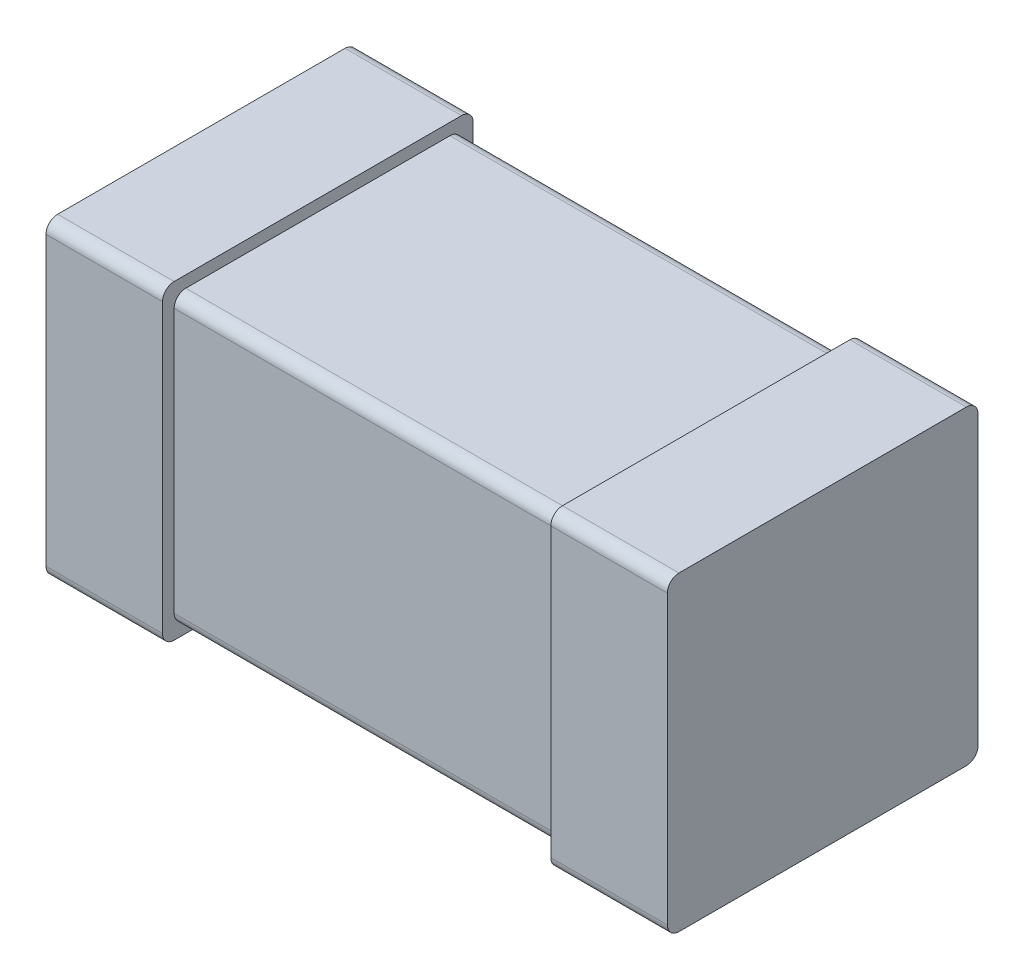
ISO-10303-21;
HEADER;
FILE_DESCRIPTION(('STEP AP214'),'2;1');
FILE_NAME('part.step','',(''),(''),'','','');
FILE_SCHEMA(('AUTOMOTIVE_DESIGN { 1 0 10303 214 1 1 1 1 }'));
ENDSEC;
DATA;
#1=APPLICATION_CONTEXT('core data for automotive mechanical design processes');
#2=APPLICATION_PROTOCOL_DEFINITION('international standard','automotive_design',2000,#1);
#3=PRODUCT_CONTEXT('',#1,'mechanical');
#4=PRODUCT('Part','Part','',(#3));
#5=PRODUCT_RELATED_PRODUCT_CATEGORY('part','',(#4));
#6=PRODUCT_DEFINITION_FORMATION('','',#4);
#7=PRODUCT_DEFINITION_CONTEXT('part definition',#1,'design');
#8=PRODUCT_DEFINITION('design','',#6,#7);
#9=PRODUCT_DEFINITION_SHAPE('','',#8);
#10=(LENGTH_UNIT() NAMED_UNIT(*) SI_UNIT(.MILLI.,.METRE.));
#11=(NAMED_UNIT(*) PLANE_ANGLE_UNIT() SI_UNIT($,.RADIAN.));
#12=(NAMED_UNIT(*) SI_UNIT($,.STERADIAN.) SOLID_ANGLE_UNIT());
#13=UNCERTAINTY_MEASURE_WITH_UNIT(LENGTH_MEASURE(1.E-05),#10,'distance_accuracy_value','');
#14=(GEOMETRIC_REPRESENTATION_CONTEXT(3) GLOBAL_UNCERTAINTY_ASSIGNED_CONTEXT((#13)) GLOBAL_UNIT_ASSIGNED_CONTEXT((#10,
#11,#12)) REPRESENTATION_CONTEXT('',''));
#15=CARTESIAN_POINT('',(0.,0.,0.));
#16=DIRECTION('',(0.,0.,1.));
#17=DIRECTION('',(1.,0.,0.));
#18=AXIS2_PLACEMENT_3D('',#15,#16,#17);
#19=CARTESIAN_POINT('',(182.439544279938,94.8825432923502,112.211582908599));
#20=DIRECTION('',(1.,0.,0.));
#21=DIRECTION('',(0.,1.,0.));
#22=AXIS2_PLACEMENT_3D('',#19,#20,#21);
#23=PLANE('',#22);
#24=DIRECTION('',(0.,0.,1.));
#25=VECTOR('',#24,1.);
#26=CARTESIAN_POINT('',(182.439544279938,94.8825432923502,112.211582908599));
#27=LINE('',#26,#25);
#28=CARTESIAN_POINT('',(182.439544279938,94.8825432923502,112.241582908599));
#29=VERTEX_POINT('',#28);
#30=CARTESIAN_POINT('',(182.439544279938,94.8825432923502,112.981582908599));
#31=VERTEX_POINT('',#30);
#32=EDGE_CURVE('E66',#29,#31,#27,.T.);
#33=ORIENTED_EDGE('',*,*,#32,.F.);
#34=CARTESIAN_POINT('',(182.439544279938,94.9125432923502,112.241582908599));
#35=DIRECTION('',(1.,0.,0.));
#36=DIRECTION('',(0.,0.,1.));
#37=AXIS2_PLACEMENT_3D('',#34,#35,#36);
#38=CIRCLE('',#37,0.0300000000000023);
#39=CARTESIAN_POINT('',(182.439544279938,94.9125432923502,112.211582908599));
#40=VERTEX_POINT('',#39);
#41=EDGE_CURVE('E11',#29,#40,#38,.T.);
#42=ORIENTED_EDGE('',*,*,#41,.T.);
#43=DIRECTION('',(0.,1.,0.));
#44=VECTOR('',#43,1.);
#45=CARTESIAN_POINT('',(182.439544279938,94.8825432923502,112.211582908599));
#46=LINE('',#45,#44);
#47=CARTESIAN_POINT('',(182.439544279938,95.6525432923502,112.211582908599));
#48=VERTEX_POINT('',#47);
#49=EDGE_CURVE('E48',#40,#48,#46,.T.);
#50=ORIENTED_EDGE('',*,*,#49,.T.);
#51=CARTESIAN_POINT('',(182.439544279938,95.6525432923502,112.241582908599));
#52=DIRECTION('',(-1.,0.,0.));
#53=DIRECTION('',(0.,0.,1.));
#54=AXIS2_PLACEMENT_3D('',#51,#52,#53);
#55=CIRCLE('',#54,0.0300000000000023);
#56=CARTESIAN_POINT('',(182.439544279938,95.6825432923502,112.241582908599));
#57=VERTEX_POINT('',#56);
#58=EDGE_CURVE('E304',#57,#48,#55,.T.);
#59=ORIENTED_EDGE('',*,*,#58,.F.);
#60=DIRECTION('',(0.,0.,1.));
#61=VECTOR('',#60,1.);
#62=CARTESIAN_POINT('',(182.439544279938,95.6825432923502,112.211582908599));
#63=LINE('',#62,#61);
#64=CARTESIAN_POINT('',(182.439544279938,95.6825432923502,112.981582908599));
#65=VERTEX_POINT('',#64);
#66=EDGE_CURVE('E350',#57,#65,#63,.T.);
#67=ORIENTED_EDGE('',*,*,#66,.T.);
#68=CARTESIAN_POINT('',(182.439544279938,95.6525432923502,112.981582908599));
#69=DIRECTION('',(1.,0.,0.));
#70=DIRECTION('',(0.,0.,1.));
#71=AXIS2_PLACEMENT_3D('',#68,#69,#70);
#72=CIRCLE('',#71,0.0300000000000023);
#73=CARTESIAN_POINT('',(182.439544279938,95.6525432923502,113.011582908599));
#74=VERTEX_POINT('',#73);
#75=EDGE_CURVE('E354',#65,#74,#72,.T.);
#76=ORIENTED_EDGE('',*,*,#75,.T.);
#77=DIRECTION('',(0.,1.,0.));
#78=VECTOR('',#77,1.);
#79=CARTESIAN_POINT('',(182.439544279938,94.8825432923502,113.011582908599));
#80=LINE('',#79,#78);
#81=CARTESIAN_POINT('',(182.439544279938,94.9125432923502,113.011582908599));
#82=VERTEX_POINT('',#81);
#83=EDGE_CURVE('E372',#82,#74,#80,.T.);
#84=ORIENTED_EDGE('',*,*,#83,.F.);
#85=CARTESIAN_POINT('',(182.439544279938,94.9125432923502,112.981582908599));
#86=DIRECTION('',(-1.,0.,0.));
#87=DIRECTION('',(0.,0.,1.));
#88=AXIS2_PLACEMENT_3D('',#85,#86,#87);
#89=CIRCLE('',#88,0.0300000000000023);
#90=EDGE_CURVE('E292',#31,#82,#89,.T.);
#91=ORIENTED_EDGE('',*,*,#90,.F.);
#92=EDGE_LOOP('',(#33,#42,#50,#59,#67,#76,#84,#91));
#93=FACE_BOUND('',#92,.T.);
#94=ADVANCED_FACE('F44',(#93),#23,.T.);
#95=CARTESIAN_POINT('',(182.139544279938,95.6825432923502,112.211582908599));
#96=DIRECTION('',(0.,1.,0.));
#97=DIRECTION('',(1.,0.,0.));
#98=AXIS2_PLACEMENT_3D('',#95,#96,#97);
#99=PLANE('',#98);
#100=ORIENTED_EDGE('',*,*,#66,.F.);
#101=DIRECTION('',(1.,0.,0.));
#102=VECTOR('',#101,1.);
#103=CARTESIAN_POINT('',(182.139544279938,95.6825432923502,112.241582908599));
#104=LINE('',#103,#102);
#105=CARTESIAN_POINT('',(182.139544279938,95.6825432923502,112.241582908599));
#106=VERTEX_POINT('',#105);
#107=EDGE_CURVE('E307',#106,#57,#104,.T.);
#108=ORIENTED_EDGE('',*,*,#107,.F.);
#109=DIRECTION('',(0.,0.,1.));
#110=VECTOR('',#109,1.);
#111=CARTESIAN_POINT('',(182.139544279938,95.6825432923502,112.211582908599));
#112=LINE('',#111,#110);
#113=CARTESIAN_POINT('',(182.139544279938,95.6825432923502,112.981582908599));
#114=VERTEX_POINT('',#113);
#115=EDGE_CURVE('E369',#106,#114,#112,.T.);
#116=ORIENTED_EDGE('',*,*,#115,.T.);
#117=DIRECTION('',(1.,0.,0.));
#118=VECTOR('',#117,1.);
#119=CARTESIAN_POINT('',(182.139544279938,95.6825432923502,112.981582908599));
#120=LINE('',#119,#118);
#121=EDGE_CURVE('E365',#114,#65,#120,.T.);
#122=ORIENTED_EDGE('',*,*,#121,.T.);
#123=EDGE_LOOP('',(#100,#108,#116,#122));
#124=FACE_BOUND('',#123,.T.);
#125=ADVANCED_FACE('F538',(#124),#99,.T.);
#126=CARTESIAN_POINT('',(182.139544279938,95.6525432923502,112.981582908599));
#127=DIRECTION('',(1.,0.,0.));
#128=DIRECTION('',(0.,1.,0.));
#129=AXIS2_PLACEMENT_3D('',#126,#127,#128);
#130=CYLINDRICAL_SURFACE('',#129,0.0300000000000023);
#131=CARTESIAN_POINT('',(182.139544279938,95.6525432923502,112.981582908599));
#132=DIRECTION('',(1.,0.,0.));
#133=DIRECTION('',(0.,0.,1.));
#134=AXIS2_PLACEMENT_3D('',#131,#132,#133);
#135=CIRCLE('',#134,0.0300000000000023);
#136=CARTESIAN_POINT('',(182.139544279938,95.6525432923502,113.011582908599));
#137=VERTEX_POINT('',#136);
#138=EDGE_CURVE('E349',#114,#137,#135,.T.);
#139=ORIENTED_EDGE('',*,*,#138,.T.);
#140=DIRECTION('',(1.,0.,0.));
#141=VECTOR('',#140,1.);
#142=CARTESIAN_POINT('',(182.139544279938,95.6525432923502,113.011582908599));
#143=LINE('',#142,#141);
#144=EDGE_CURVE('E345',#137,#74,#143,.T.);
#145=ORIENTED_EDGE('',*,*,#144,.T.);
#146=ORIENTED_EDGE('',*,*,#75,.F.);
#147=ORIENTED_EDGE('',*,*,#121,.F.);
#148=EDGE_LOOP('',(#139,#145,#146,#147));
#149=FACE_BOUND('',#148,.T.);
#150=ADVANCED_FACE('F533',(#149),#130,.T.);
#151=CARTESIAN_POINT('',(182.139544279938,95.6525432923502,112.241582908599));
#152=DIRECTION('',(1.,0.,0.));
#153=DIRECTION('',(0.,1.,0.));
#154=AXIS2_PLACEMENT_3D('',#151,#152,#153);
#155=CYLINDRICAL_SURFACE('',#154,0.0300000000000023);
#156=ORIENTED_EDGE('',*,*,#107,.T.);
#157=ORIENTED_EDGE('',*,*,#58,.T.);
#158=DIRECTION('',(1.,0.,0.));
#159=VECTOR('',#158,1.);
#160=CARTESIAN_POINT('',(182.139544279938,95.6525432923502,112.211582908599));
#161=LINE('',#160,#159);
#162=CARTESIAN_POINT('',(182.139544279938,95.6525432923502,112.211582908599));
#163=VERTEX_POINT('',#162);
#164=EDGE_CURVE('E374',#163,#48,#161,.T.);
#165=ORIENTED_EDGE('',*,*,#164,.F.);
#166=CARTESIAN_POINT('',(182.139544279938,95.6525432923502,112.241582908599));
#167=DIRECTION('',(-1.,0.,0.));
#168=DIRECTION('',(0.,0.,1.));
#169=AXIS2_PLACEMENT_3D('',#166,#167,#168);
#170=CIRCLE('',#169,0.0300000000000023);
#171=EDGE_CURVE('E313',#106,#163,#170,.T.);
#172=ORIENTED_EDGE('',*,*,#171,.F.);
#173=EDGE_LOOP('',(#156,#157,#165,#172));
#174=FACE_BOUND('',#173,.T.);
#175=ADVANCED_FACE('F542',(#174),#155,.T.);
#176=CARTESIAN_POINT('',(182.139544279938,94.8825432923502,113.011582908599));
#177=DIRECTION('',(0.,0.,1.));
#178=DIRECTION('',(1.,0.,0.));
#179=AXIS2_PLACEMENT_3D('',#176,#177,#178);
#180=PLANE('',#179);
#181=DIRECTION('',(0.,1.,0.));
#182=VECTOR('',#181,1.);
#183=CARTESIAN_POINT('',(182.139544279938,94.8825432923502,113.011582908599));
#184=LINE('',#183,#182);
#185=CARTESIAN_POINT('',(182.139544279938,94.9125432923502,113.011582908599));
#186=VERTEX_POINT('',#185);
#187=EDGE_CURVE('E446',#186,#137,#184,.T.);
#188=ORIENTED_EDGE('',*,*,#187,.F.);
#189=DIRECTION('',(1.,0.,0.));
#190=VECTOR('',#189,1.);
#191=CARTESIAN_POINT('',(182.139544279938,94.9125432923502,113.011582908599));
#192=LINE('',#191,#190);
#193=EDGE_CURVE('E308',#186,#82,#192,.T.);
#194=ORIENTED_EDGE('',*,*,#193,.T.);
#195=ORIENTED_EDGE('',*,*,#83,.T.);
#196=ORIENTED_EDGE('',*,*,#144,.F.);
#197=EDGE_LOOP('',(#188,#194,#195,#196));
#198=FACE_BOUND('',#197,.T.);
#199=ADVANCED_FACE('F530',(#198),#180,.T.);
#200=CARTESIAN_POINT('',(182.139544279938,94.8825432923502,112.211582908599));
#201=DIRECTION('',(0.,0.,1.));
#202=DIRECTION('',(1.,0.,0.));
#203=AXIS2_PLACEMENT_3D('',#200,#201,#202);
#204=PLANE('',#203);
#205=ORIENTED_EDGE('',*,*,#164,.T.);
#206=ORIENTED_EDGE('',*,*,#49,.F.);
#207=DIRECTION('',(1.,0.,0.));
#208=VECTOR('',#207,1.);
#209=CARTESIAN_POINT('',(182.139544279938,94.9125432923502,112.211582908599));
#210=LINE('',#209,#208);
#211=CARTESIAN_POINT('',(182.139544279938,94.9125432923502,112.211582908599));
#212=VERTEX_POINT('',#211);
#213=EDGE_CURVE('E303',#212,#40,#210,.T.);
#214=ORIENTED_EDGE('',*,*,#213,.F.);
#215=DIRECTION('',(0.,1.,0.));
#216=VECTOR('',#215,1.);
#217=CARTESIAN_POINT('',(182.139544279938,94.8825432923502,112.211582908599));
#218=LINE('',#217,#216);
#219=EDGE_CURVE('E291',#212,#163,#218,.T.);
#220=ORIENTED_EDGE('',*,*,#219,.T.);
#221=EDGE_LOOP('',(#205,#206,#214,#220));
#222=FACE_BOUND('',#221,.T.);
#223=ADVANCED_FACE('F546',(#222),#204,.F.);
#224=CARTESIAN_POINT('',(182.139544279938,94.9125432923502,112.981582908599));
#225=DIRECTION('',(1.,0.,0.));
#226=DIRECTION('',(0.,-1.,0.));
#227=AXIS2_PLACEMENT_3D('',#224,#225,#226);
#228=CYLINDRICAL_SURFACE('',#227,0.0300000000000023);
#229=DIRECTION('',(1.,0.,0.));
#230=VECTOR('',#229,1.);
#231=CARTESIAN_POINT('',(182.139544279938,94.8825432923502,112.981582908599));
#232=LINE('',#231,#230);
#233=CARTESIAN_POINT('',(182.139544279938,94.8825432923502,112.981582908599));
#234=VERTEX_POINT('',#233);
#235=EDGE_CURVE('E287',#234,#31,#232,.T.);
#236=ORIENTED_EDGE('',*,*,#235,.T.);
#237=ORIENTED_EDGE('',*,*,#90,.T.);
#238=ORIENTED_EDGE('',*,*,#193,.F.);
#239=CARTESIAN_POINT('',(182.139544279938,94.9125432923502,112.981582908599));
#240=DIRECTION('',(-1.,0.,0.));
#241=DIRECTION('',(0.,0.,1.));
#242=AXIS2_PLACEMENT_3D('',#239,#240,#241);
#243=CIRCLE('',#242,0.0300000000000023);
#244=EDGE_CURVE('E443',#234,#186,#243,.T.);
#245=ORIENTED_EDGE('',*,*,#244,.F.);
#246=EDGE_LOOP('',(#236,#237,#238,#245));
#247=FACE_BOUND('',#246,.T.);
#248=ADVANCED_FACE('F524',(#247),#228,.T.);
#249=CARTESIAN_POINT('',(182.139544279938,94.9125432923502,112.241582908599));
#250=DIRECTION('',(1.,0.,0.));
#251=DIRECTION('',(0.,-1.,0.));
#252=AXIS2_PLACEMENT_3D('',#249,#250,#251);
#253=CYLINDRICAL_SURFACE('',#252,0.0300000000000023);
#254=CARTESIAN_POINT('',(182.139544279938,94.9125432923502,112.241582908599));
#255=DIRECTION('',(1.,0.,0.));
#256=DIRECTION('',(0.,0.,1.));
#257=AXIS2_PLACEMENT_3D('',#254,#255,#256);
#258=CIRCLE('',#257,0.0300000000000023);
#259=CARTESIAN_POINT('',(182.139544279938,94.8825432923502,112.241582908599));
#260=VERTEX_POINT('',#259);
#261=EDGE_CURVE('E404',#260,#212,#258,.T.);
#262=ORIENTED_EDGE('',*,*,#261,.T.);
#263=ORIENTED_EDGE('',*,*,#213,.T.);
#264=ORIENTED_EDGE('',*,*,#41,.F.);
#265=DIRECTION('',(1.,0.,0.));
#266=VECTOR('',#265,1.);
#267=CARTESIAN_POINT('',(182.139544279938,94.8825432923502,112.241582908599));
#268=LINE('',#267,#266);
#269=EDGE_CURVE('E299',#260,#29,#268,.T.);
#270=ORIENTED_EDGE('',*,*,#269,.F.);
#271=EDGE_LOOP('',(#262,#263,#264,#270));
#272=FACE_BOUND('',#271,.T.);
#273=ADVANCED_FACE('F514',(#272),#253,.T.);
#274=CARTESIAN_POINT('',(182.139544279938,94.8825432923502,112.211582908599));
#275=DIRECTION('',(0.,1.,0.));
#276=DIRECTION('',(1.,0.,0.));
#277=AXIS2_PLACEMENT_3D('',#274,#275,#276);
#278=PLANE('',#277);
#279=ORIENTED_EDGE('',*,*,#235,.F.);
#280=DIRECTION('',(0.,0.,1.));
#281=VECTOR('',#280,1.);
#282=CARTESIAN_POINT('',(182.139544279938,94.8825432923502,112.211582908599));
#283=LINE('',#282,#281);
#284=EDGE_CURVE('E309',#260,#234,#283,.T.);
#285=ORIENTED_EDGE('',*,*,#284,.F.);
#286=ORIENTED_EDGE('',*,*,#269,.T.);
#287=ORIENTED_EDGE('',*,*,#32,.T.);
#288=EDGE_LOOP('',(#279,#285,#286,#287));
#289=FACE_BOUND('',#288,.T.);
#290=ADVANCED_FACE('F522',(#289),#278,.F.);
#291=CARTESIAN_POINT('',(182.139544279938,94.8825432923502,112.211582908599));
#292=DIRECTION('',(1.,0.,0.));
#293=DIRECTION('',(0.,1.,0.));
#294=AXIS2_PLACEMENT_3D('',#291,#292,#293);
#295=PLANE('',#294);
#296=ORIENTED_EDGE('',*,*,#244,.T.);
#297=ORIENTED_EDGE('',*,*,#187,.T.);
#298=ORIENTED_EDGE('',*,*,#138,.F.);
#299=ORIENTED_EDGE('',*,*,#115,.F.);
#300=ORIENTED_EDGE('',*,*,#171,.T.);
#301=ORIENTED_EDGE('',*,*,#219,.F.);
#302=ORIENTED_EDGE('',*,*,#261,.F.);
#303=ORIENTED_EDGE('',*,*,#284,.T.);
#304=EDGE_LOOP('',(#296,#297,#298,#299,#300,#301,#302,#303));
#305=FACE_BOUND('',#304,.T.);
#306=DIRECTION('',(0.,1.,0.));
#307=VECTOR('',#306,1.);
#308=CARTESIAN_POINT('',(182.139544279938,94.9125432923502,112.241582908599));
#309=LINE('',#308,#307);
#310=CARTESIAN_POINT('',(182.139544279938,94.9425432923502,112.241582908599));
#311=VERTEX_POINT('',#310);
#312=CARTESIAN_POINT('',(182.139544279938,95.6225432923502,112.241582908599));
#313=VERTEX_POINT('',#312);
#314=EDGE_CURVE('E314',#311,#313,#309,.T.);
#315=ORIENTED_EDGE('',*,*,#314,.T.);
#316=CARTESIAN_POINT('',(182.139544279938,95.6225432923502,112.271582908599));
#317=DIRECTION('',(-1.,0.,0.));
#318=DIRECTION('',(0.,0.,1.));
#319=AXIS2_PLACEMENT_3D('',#316,#317,#318);
#320=CIRCLE('',#319,0.0300000000000023);
#321=CARTESIAN_POINT('',(182.139544279938,95.6525432923502,112.271582908599));
#322=VERTEX_POINT('',#321);
#323=EDGE_CURVE('E249',#322,#313,#320,.T.);
#324=ORIENTED_EDGE('',*,*,#323,.F.);
#325=DIRECTION('',(0.,0.,1.));
#326=VECTOR('',#325,1.);
#327=CARTESIAN_POINT('',(182.139544279938,95.6525432923502,112.241582908599));
#328=LINE('',#327,#326);
#329=CARTESIAN_POINT('',(182.139544279938,95.6525432923502,112.951582908599));
#330=VERTEX_POINT('',#329);
#331=EDGE_CURVE('E244',#322,#330,#328,.T.);
#332=ORIENTED_EDGE('',*,*,#331,.T.);
#333=CARTESIAN_POINT('',(182.139544279938,95.6225432923502,112.951582908599));
#334=DIRECTION('',(1.,0.,0.));
#335=DIRECTION('',(0.,0.,1.));
#336=AXIS2_PLACEMENT_3D('',#333,#334,#335);
#337=CIRCLE('',#336,0.0300000000000023);
#338=CARTESIAN_POINT('',(182.139544279938,95.6225432923502,112.981582908599));
#339=VERTEX_POINT('',#338);
#340=EDGE_CURVE('E315',#330,#339,#337,.T.);
#341=ORIENTED_EDGE('',*,*,#340,.T.);
#342=DIRECTION('',(0.,1.,0.));
#343=VECTOR('',#342,1.);
#344=CARTESIAN_POINT('',(182.139544279938,94.9125432923502,112.981582908599));
#345=LINE('',#344,#343);
#346=CARTESIAN_POINT('',(182.139544279938,94.9425432923502,112.981582908599));
#347=VERTEX_POINT('',#346);
#348=EDGE_CURVE('E293',#347,#339,#345,.T.);
#349=ORIENTED_EDGE('',*,*,#348,.F.);
#350=CARTESIAN_POINT('',(182.139544279938,94.9425432923502,112.951582908599));
#351=DIRECTION('',(-1.,0.,0.));
#352=DIRECTION('',(0.,0.,1.));
#353=AXIS2_PLACEMENT_3D('',#350,#351,#352);
#354=CIRCLE('',#353,0.0300000000000023);
#355=CARTESIAN_POINT('',(182.139544279938,94.9125432923502,112.951582908599));
#356=VERTEX_POINT('',#355);
#357=EDGE_CURVE('E388',#356,#347,#354,.T.);
#358=ORIENTED_EDGE('',*,*,#357,.F.);
#359=DIRECTION('',(0.,0.,1.));
#360=VECTOR('',#359,1.);
#361=CARTESIAN_POINT('',(182.139544279938,94.9125432923502,112.241582908599));
#362=LINE('',#361,#360);
#363=CARTESIAN_POINT('',(182.139544279938,94.9125432923502,112.271582908599));
#364=VERTEX_POINT('',#363);
#365=EDGE_CURVE('E397',#364,#356,#362,.T.);
#366=ORIENTED_EDGE('',*,*,#365,.F.);
#367=CARTESIAN_POINT('',(182.139544279938,94.9425432923502,112.271582908599));
#368=DIRECTION('',(1.,0.,0.));
#369=DIRECTION('',(0.,0.,1.));
#370=AXIS2_PLACEMENT_3D('',#367,#368,#369);
#371=CIRCLE('',#370,0.0300000000000023);
#372=EDGE_CURVE('E319',#364,#311,#371,.T.);
#373=ORIENTED_EDGE('',*,*,#372,.T.);
#374=EDGE_LOOP('',(#315,#324,#332,#341,#349,#358,#366,#373));
#375=FACE_BOUND('',#374,.T.);
#376=ADVANCED_FACE('F518',(#305,#375),#295,.F.);
#377=CARTESIAN_POINT('',(181.139544279938,94.9125432923502,112.241582908599));
#378=DIRECTION('',(0.,1.,0.));
#379=DIRECTION('',(1.,0.,0.));
#380=AXIS2_PLACEMENT_3D('',#377,#378,#379);
#381=PLANE('',#380);
#382=DIRECTION('',(1.,0.,0.));
#383=VECTOR('',#382,1.);
#384=CARTESIAN_POINT('',(181.139544279938,94.9125432923502,112.951582908599));
#385=LINE('',#384,#383);
#386=CARTESIAN_POINT('',(181.139544279938,94.9125432923502,112.951582908599));
#387=VERTEX_POINT('',#386);
#388=EDGE_CURVE('E392',#387,#356,#385,.T.);
#389=ORIENTED_EDGE('',*,*,#388,.F.);
#390=DIRECTION('',(0.,0.,1.));
#391=VECTOR('',#390,1.);
#392=CARTESIAN_POINT('',(181.139544279938,94.9125432923502,112.241582908599));
#393=LINE('',#392,#391);
#394=CARTESIAN_POINT('',(181.139544279938,94.9125432923502,112.271582908599));
#395=VERTEX_POINT('',#394);
#396=EDGE_CURVE('E286',#395,#387,#393,.T.);
#397=ORIENTED_EDGE('',*,*,#396,.F.);
#398=DIRECTION('',(1.,0.,0.));
#399=VECTOR('',#398,1.);
#400=CARTESIAN_POINT('',(181.139544279938,94.9125432923502,112.271582908599));
#401=LINE('',#400,#399);
#402=EDGE_CURVE('E393',#395,#364,#401,.T.);
#403=ORIENTED_EDGE('',*,*,#402,.T.);
#404=ORIENTED_EDGE('',*,*,#365,.T.);
#405=EDGE_LOOP('',(#389,#397,#403,#404));
#406=FACE_BOUND('',#405,.T.);
#407=ADVANCED_FACE('F46',(#406),#381,.F.);
#408=CARTESIAN_POINT('',(181.139544279938,94.9425432923502,112.951582908599));
#409=DIRECTION('',(1.,0.,0.));
#410=DIRECTION('',(0.,-1.,0.));
#411=AXIS2_PLACEMENT_3D('',#408,#409,#410);
#412=CYLINDRICAL_SURFACE('',#411,0.0300000000000023);
#413=ORIENTED_EDGE('',*,*,#388,.T.);
#414=ORIENTED_EDGE('',*,*,#357,.T.);
#415=DIRECTION('',(1.,0.,0.));
#416=VECTOR('',#415,1.);
#417=CARTESIAN_POINT('',(181.139544279938,94.9425432923502,112.981582908599));
#418=LINE('',#417,#416);
#419=CARTESIAN_POINT('',(181.139544279938,94.9425432923502,112.981582908599));
#420=VERTEX_POINT('',#419);
#421=EDGE_CURVE('E296',#420,#347,#418,.T.);
#422=ORIENTED_EDGE('',*,*,#421,.F.);
#423=CARTESIAN_POINT('',(181.139544279938,94.9425432923502,112.951582908599));
#424=DIRECTION('',(-1.,0.,0.));
#425=DIRECTION('',(0.,0.,1.));
#426=AXIS2_PLACEMENT_3D('',#423,#424,#425);
#427=CIRCLE('',#426,0.0300000000000023);
#428=EDGE_CURVE('E274',#387,#420,#427,.T.);
#429=ORIENTED_EDGE('',*,*,#428,.F.);
#430=EDGE_LOOP('',(#413,#414,#422,#429));
#431=FACE_BOUND('',#430,.T.);
#432=ADVANCED_FACE('F595',(#431),#412,.T.);
#433=CARTESIAN_POINT('',(181.139544279938,94.9125432923502,112.981582908599));
#434=DIRECTION('',(0.,0.,1.));
#435=DIRECTION('',(1.,0.,0.));
#436=AXIS2_PLACEMENT_3D('',#433,#434,#435);
#437=PLANE('',#436);
#438=DIRECTION('',(0.,1.,0.));
#439=VECTOR('',#438,1.);
#440=CARTESIAN_POINT('',(181.139544279938,94.9125432923502,112.981582908599));
#441=LINE('',#440,#439);
#442=CARTESIAN_POINT('',(181.139544279938,95.6225432923502,112.981582908599));
#443=VERTEX_POINT('',#442);
#444=EDGE_CURVE('E267',#420,#443,#441,.T.);
#445=ORIENTED_EDGE('',*,*,#444,.F.);
#446=ORIENTED_EDGE('',*,*,#421,.T.);
#447=ORIENTED_EDGE('',*,*,#348,.T.);
#448=DIRECTION('',(1.,0.,0.));
#449=VECTOR('',#448,1.);
#450=CARTESIAN_POINT('',(181.139544279938,95.6225432923502,112.981582908599));
#451=LINE('',#450,#449);
#452=EDGE_CURVE('E260',#443,#339,#451,.T.);
#453=ORIENTED_EDGE('',*,*,#452,.F.);
#454=EDGE_LOOP('',(#445,#446,#447,#453));
#455=FACE_BOUND('',#454,.T.);
#456=ADVANCED_FACE('F591',(#455),#437,.T.);
#457=CARTESIAN_POINT('',(181.139544279938,95.6225432923502,112.951582908599));
#458=DIRECTION('',(1.,0.,0.));
#459=DIRECTION('',(0.,1.,0.));
#460=AXIS2_PLACEMENT_3D('',#457,#458,#459);
#461=CYLINDRICAL_SURFACE('',#460,0.0300000000000023);
#462=CARTESIAN_POINT('',(181.139544279938,95.6225432923502,112.951582908599));
#463=DIRECTION('',(1.,0.,0.));
#464=DIRECTION('',(0.,0.,1.));
#465=AXIS2_PLACEMENT_3D('',#462,#463,#464);
#466=CIRCLE('',#465,0.0300000000000023);
#467=CARTESIAN_POINT('',(181.139544279938,95.6525432923502,112.951582908599));
#468=VERTEX_POINT('',#467);
#469=EDGE_CURVE('E258',#468,#443,#466,.T.);
#470=ORIENTED_EDGE('',*,*,#469,.T.);
#471=ORIENTED_EDGE('',*,*,#452,.T.);
#472=ORIENTED_EDGE('',*,*,#340,.F.);
#473=DIRECTION('',(1.,0.,0.));
#474=VECTOR('',#473,1.);
#475=CARTESIAN_POINT('',(181.139544279938,95.6525432923502,112.951582908599));
#476=LINE('',#475,#474);
#477=EDGE_CURVE('E248',#468,#330,#476,.T.);
#478=ORIENTED_EDGE('',*,*,#477,.F.);
#479=EDGE_LOOP('',(#470,#471,#472,#478));
#480=FACE_BOUND('',#479,.T.);
#481=ADVANCED_FACE('F594',(#480),#461,.T.);
#482=CARTESIAN_POINT('',(181.139544279938,95.6525432923502,112.241582908599));
#483=DIRECTION('',(0.,1.,0.));
#484=DIRECTION('',(1.,0.,0.));
#485=AXIS2_PLACEMENT_3D('',#482,#483,#484);
#486=PLANE('',#485);
#487=ORIENTED_EDGE('',*,*,#331,.F.);
#488=DIRECTION('',(1.,0.,0.));
#489=VECTOR('',#488,1.);
#490=CARTESIAN_POINT('',(181.139544279938,95.6525432923502,112.271582908599));
#491=LINE('',#490,#489);
#492=CARTESIAN_POINT('',(181.139544279938,95.6525432923502,112.271582908599));
#493=VERTEX_POINT('',#492);
#494=EDGE_CURVE('E238',#493,#322,#491,.T.);
#495=ORIENTED_EDGE('',*,*,#494,.F.);
#496=DIRECTION('',(0.,0.,1.));
#497=VECTOR('',#496,1.);
#498=CARTESIAN_POINT('',(181.139544279938,95.6525432923502,112.241582908599));
#499=LINE('',#498,#497);
#500=EDGE_CURVE('E242',#493,#468,#499,.T.);
#501=ORIENTED_EDGE('',*,*,#500,.T.);
#502=ORIENTED_EDGE('',*,*,#477,.T.);
#503=EDGE_LOOP('',(#487,#495,#501,#502));
#504=FACE_BOUND('',#503,.T.);
#505=ADVANCED_FACE('F240',(#504),#486,.T.);
#506=CARTESIAN_POINT('',(181.139544279938,95.6225432923502,112.271582908599));
#507=DIRECTION('',(1.,0.,0.));
#508=DIRECTION('',(0.,1.,0.));
#509=AXIS2_PLACEMENT_3D('',#506,#507,#508);
#510=CYLINDRICAL_SURFACE('',#509,0.0300000000000023);
#511=ORIENTED_EDGE('',*,*,#494,.T.);
#512=ORIENTED_EDGE('',*,*,#323,.T.);
#513=DIRECTION('',(1.,0.,0.));
#514=VECTOR('',#513,1.);
#515=CARTESIAN_POINT('',(181.139544279938,95.6225432923502,112.241582908599));
#516=LINE('',#515,#514);
#517=CARTESIAN_POINT('',(181.139544279938,95.6225432923502,112.241582908599));
#518=VERTEX_POINT('',#517);
#519=EDGE_CURVE('E264',#518,#313,#516,.T.);
#520=ORIENTED_EDGE('',*,*,#519,.F.);
#521=CARTESIAN_POINT('',(181.139544279938,95.6225432923502,112.271582908599));
#522=DIRECTION('',(-1.,0.,0.));
#523=DIRECTION('',(0.,0.,1.));
#524=AXIS2_PLACEMENT_3D('',#521,#522,#523);
#525=CIRCLE('',#524,0.0300000000000023);
#526=EDGE_CURVE('E255',#493,#518,#525,.T.);
#527=ORIENTED_EDGE('',*,*,#526,.F.);
#528=EDGE_LOOP('',(#511,#512,#520,#527));
#529=FACE_BOUND('',#528,.T.);
#530=ADVANCED_FACE('F262',(#529),#510,.T.);
#531=CARTESIAN_POINT('',(181.139544279938,94.9125432923502,112.241582908599));
#532=DIRECTION('',(0.,0.,1.));
#533=DIRECTION('',(1.,0.,0.));
#534=AXIS2_PLACEMENT_3D('',#531,#532,#533);
#535=PLANE('',#534);
#536=ORIENTED_EDGE('',*,*,#519,.T.);
#537=ORIENTED_EDGE('',*,*,#314,.F.);
#538=DIRECTION('',(1.,0.,0.));
#539=VECTOR('',#538,1.);
#540=CARTESIAN_POINT('',(181.139544279938,94.9425432923502,112.241582908599));
#541=LINE('',#540,#539);
#542=CARTESIAN_POINT('',(181.139544279938,94.9425432923502,112.241582908599));
#543=VERTEX_POINT('',#542);
#544=EDGE_CURVE('E325',#543,#311,#541,.T.);
#545=ORIENTED_EDGE('',*,*,#544,.F.);
#546=DIRECTION('',(0.,1.,0.));
#547=VECTOR('',#546,1.);
#548=CARTESIAN_POINT('',(181.139544279938,94.9125432923502,112.241582908599));
#549=LINE('',#548,#547);
#550=EDGE_CURVE('E324',#543,#518,#549,.T.);
#551=ORIENTED_EDGE('',*,*,#550,.T.);
#552=EDGE_LOOP('',(#536,#537,#545,#551));
#553=FACE_BOUND('',#552,.T.);
#554=ADVANCED_FACE('F608',(#553),#535,.F.);
#555=CARTESIAN_POINT('',(181.139544279938,94.9425432923502,112.271582908599));
#556=DIRECTION('',(1.,0.,0.));
#557=DIRECTION('',(0.,-1.,0.));
#558=AXIS2_PLACEMENT_3D('',#555,#556,#557);
#559=CYLINDRICAL_SURFACE('',#558,0.0300000000000023);
#560=CARTESIAN_POINT('',(181.139544279938,94.9425432923502,112.271582908599));
#561=DIRECTION('',(1.,0.,0.));
#562=DIRECTION('',(0.,0.,1.));
#563=AXIS2_PLACEMENT_3D('',#560,#561,#562);
#564=CIRCLE('',#563,0.0300000000000023);
#565=EDGE_CURVE('E320',#395,#543,#564,.T.);
#566=ORIENTED_EDGE('',*,*,#565,.T.);
#567=ORIENTED_EDGE('',*,*,#544,.T.);
#568=ORIENTED_EDGE('',*,*,#372,.F.);
#569=ORIENTED_EDGE('',*,*,#402,.F.);
#570=EDGE_LOOP('',(#566,#567,#568,#569));
#571=FACE_BOUND('',#570,.T.);
#572=ADVANCED_FACE('F563',(#571),#559,.T.);
#573=CARTESIAN_POINT('',(181.139544279938,94.8825432923502,112.211582908599));
#574=DIRECTION('',(1.,0.,0.));
#575=DIRECTION('',(0.,1.,0.));
#576=AXIS2_PLACEMENT_3D('',#573,#574,#575);
#577=PLANE('',#576);
#578=DIRECTION('',(0.,0.,1.));
#579=VECTOR('',#578,1.);
#580=CARTESIAN_POINT('',(181.139544279938,94.8825432923502,112.211582908599));
#581=LINE('',#580,#579);
#582=CARTESIAN_POINT('',(181.139544279938,94.8825432923502,112.241582908599));
#583=VERTEX_POINT('',#582);
#584=CARTESIAN_POINT('',(181.139544279938,94.8825432923502,112.981582908599));
#585=VERTEX_POINT('',#584);
#586=EDGE_CURVE('E355',#583,#585,#581,.T.);
#587=ORIENTED_EDGE('',*,*,#586,.F.);
#588=CARTESIAN_POINT('',(181.139544279938,94.9125432923502,112.241582908599));
#589=DIRECTION('',(1.,0.,0.));
#590=DIRECTION('',(0.,0.,1.));
#591=AXIS2_PLACEMENT_3D('',#588,#589,#590);
#592=CIRCLE('',#591,0.0300000000000023);
#593=CARTESIAN_POINT('',(181.139544279938,94.9125432923502,112.211582908599));
#594=VERTEX_POINT('',#593);
#595=EDGE_CURVE('E364',#583,#594,#592,.T.);
#596=ORIENTED_EDGE('',*,*,#595,.T.);
#597=DIRECTION('',(0.,1.,0.));
#598=VECTOR('',#597,1.);
#599=CARTESIAN_POINT('',(181.139544279938,94.8825432923502,112.211582908599));
#600=LINE('',#599,#598);
#601=CARTESIAN_POINT('',(181.139544279938,95.6525432923502,112.211582908599));
#602=VERTEX_POINT('',#601);
#603=EDGE_CURVE('E360',#594,#602,#600,.T.);
#604=ORIENTED_EDGE('',*,*,#603,.T.);
#605=CARTESIAN_POINT('',(181.139544279938,95.6525432923502,112.241582908599));
#606=DIRECTION('',(-1.,0.,0.));
#607=DIRECTION('',(0.,0.,1.));
#608=AXIS2_PLACEMENT_3D('',#605,#606,#607);
#609=CIRCLE('',#608,0.0300000000000023);
#610=CARTESIAN_POINT('',(181.139544279938,95.6825432923502,112.241582908599));
#611=VERTEX_POINT('',#610);
#612=EDGE_CURVE('E435',#611,#602,#609,.T.);
#613=ORIENTED_EDGE('',*,*,#612,.F.);
#614=DIRECTION('',(0.,0.,1.));
#615=VECTOR('',#614,1.);
#616=CARTESIAN_POINT('',(181.139544279938,95.6825432923502,112.211582908599));
#617=LINE('',#616,#615);
#618=CARTESIAN_POINT('',(181.139544279938,95.6825432923502,112.981582908599));
#619=VERTEX_POINT('',#618);
#620=EDGE_CURVE('E285',#611,#619,#617,.T.);
#621=ORIENTED_EDGE('',*,*,#620,.T.);
#622=CARTESIAN_POINT('',(181.139544279938,95.6525432923502,112.981582908599));
#623=DIRECTION('',(1.,0.,0.));
#624=DIRECTION('',(0.,0.,1.));
#625=AXIS2_PLACEMENT_3D('',#622,#623,#624);
#626=CIRCLE('',#625,0.0300000000000023);
#627=CARTESIAN_POINT('',(181.139544279938,95.6525432923502,113.011582908599));
#628=VERTEX_POINT('',#627);
#629=EDGE_CURVE('E282',#619,#628,#626,.T.);
#630=ORIENTED_EDGE('',*,*,#629,.T.);
#631=DIRECTION('',(0.,1.,0.));
#632=VECTOR('',#631,1.);
#633=CARTESIAN_POINT('',(181.139544279938,94.8825432923502,113.011582908599));
#634=LINE('',#633,#632);
#635=CARTESIAN_POINT('',(181.139544279938,94.9125432923502,113.011582908599));
#636=VERTEX_POINT('',#635);
#637=EDGE_CURVE('E326',#636,#628,#634,.T.);
#638=ORIENTED_EDGE('',*,*,#637,.F.);
#639=CARTESIAN_POINT('',(181.139544279938,94.9125432923502,112.981582908599));
#640=DIRECTION('',(-1.,0.,0.));
#641=DIRECTION('',(0.,0.,1.));
#642=AXIS2_PLACEMENT_3D('',#639,#640,#641);
#643=CIRCLE('',#642,0.0300000000000023);
#644=EDGE_CURVE('E331',#585,#636,#643,.T.);
#645=ORIENTED_EDGE('',*,*,#644,.F.);
#646=EDGE_LOOP('',(#587,#596,#604,#613,#621,#630,#638,#645));
#647=FACE_BOUND('',#646,.T.);
#648=ORIENTED_EDGE('',*,*,#565,.F.);
#649=ORIENTED_EDGE('',*,*,#396,.T.);
#650=ORIENTED_EDGE('',*,*,#428,.T.);
#651=ORIENTED_EDGE('',*,*,#444,.T.);
#652=ORIENTED_EDGE('',*,*,#469,.F.);
#653=ORIENTED_EDGE('',*,*,#500,.F.);
#654=ORIENTED_EDGE('',*,*,#526,.T.);
#655=ORIENTED_EDGE('',*,*,#550,.F.);
#656=EDGE_LOOP('',(#648,#649,#650,#651,#652,#653,#654,#655));
#657=FACE_BOUND('',#656,.T.);
#658=ADVANCED_FACE('F253',(#647,#657),#577,.T.);
#659=CARTESIAN_POINT('',(180.839544279938,95.6825432923502,112.211582908599));
#660=DIRECTION('',(0.,1.,0.));
#661=DIRECTION('',(1.,0.,0.));
#662=AXIS2_PLACEMENT_3D('',#659,#660,#661);
#663=PLANE('',#662);
#664=ORIENTED_EDGE('',*,*,#620,.F.);
#665=DIRECTION('',(1.,0.,0.));
#666=VECTOR('',#665,1.);
#667=CARTESIAN_POINT('',(180.839544279938,95.6825432923502,112.241582908599));
#668=LINE('',#667,#666);
#669=CARTESIAN_POINT('',(180.839544279938,95.6825432923502,112.241582908599));
#670=VERTEX_POINT('',#669);
#671=EDGE_CURVE('E431',#670,#611,#668,.T.);
#672=ORIENTED_EDGE('',*,*,#671,.F.);
#673=DIRECTION('',(0.,0.,1.));
#674=VECTOR('',#673,1.);
#675=CARTESIAN_POINT('',(180.839544279938,95.6825432923502,112.211582908599));
#676=LINE('',#675,#674);
#677=CARTESIAN_POINT('',(180.839544279938,95.6825432923502,112.981582908599));
#678=VERTEX_POINT('',#677);
#679=EDGE_CURVE('E268',#670,#678,#676,.T.);
#680=ORIENTED_EDGE('',*,*,#679,.T.);
#681=DIRECTION('',(1.,0.,0.));
#682=VECTOR('',#681,1.);
#683=CARTESIAN_POINT('',(180.839544279938,95.6825432923502,112.981582908599));
#684=LINE('',#683,#682);
#685=EDGE_CURVE('E278',#678,#619,#684,.T.);
#686=ORIENTED_EDGE('',*,*,#685,.T.);
#687=EDGE_LOOP('',(#664,#672,#680,#686));
#688=FACE_BOUND('',#687,.T.);
#689=ADVANCED_FACE('F556',(#688),#663,.T.);
#690=CARTESIAN_POINT('',(180.839544279938,95.6525432923502,112.981582908599));
#691=DIRECTION('',(1.,0.,0.));
#692=DIRECTION('',(0.,1.,0.));
#693=AXIS2_PLACEMENT_3D('',#690,#691,#692);
#694=CYLINDRICAL_SURFACE('',#693,0.0300000000000023);
#695=CARTESIAN_POINT('',(180.839544279938,95.6525432923502,112.981582908599));
#696=DIRECTION('',(1.,0.,0.));
#697=DIRECTION('',(0.,0.,1.));
#698=AXIS2_PLACEMENT_3D('',#695,#696,#697);
#699=CIRCLE('',#698,0.0300000000000023);
#700=CARTESIAN_POINT('',(180.839544279938,95.6525432923502,113.011582908599));
#701=VERTEX_POINT('',#700);
#702=EDGE_CURVE('E380',#678,#701,#699,.T.);
#703=ORIENTED_EDGE('',*,*,#702,.T.);
#704=DIRECTION('',(1.,0.,0.));
#705=VECTOR('',#704,1.);
#706=CARTESIAN_POINT('',(180.839544279938,95.6525432923502,113.011582908599));
#707=LINE('',#706,#705);
#708=EDGE_CURVE('E408',#701,#628,#707,.T.);
#709=ORIENTED_EDGE('',*,*,#708,.T.);
#710=ORIENTED_EDGE('',*,*,#629,.F.);
#711=ORIENTED_EDGE('',*,*,#685,.F.);
#712=EDGE_LOOP('',(#703,#709,#710,#711));
#713=FACE_BOUND('',#712,.T.);
#714=ADVANCED_FACE('F559',(#713),#694,.T.);
#715=CARTESIAN_POINT('',(180.839544279938,95.6525432923502,112.241582908599));
#716=DIRECTION('',(1.,0.,0.));
#717=DIRECTION('',(0.,1.,0.));
#718=AXIS2_PLACEMENT_3D('',#715,#716,#717);
#719=CYLINDRICAL_SURFACE('',#718,0.0300000000000023);
#720=ORIENTED_EDGE('',*,*,#671,.T.);
#721=ORIENTED_EDGE('',*,*,#612,.T.);
#722=DIRECTION('',(1.,0.,0.));
#723=VECTOR('',#722,1.);
#724=CARTESIAN_POINT('',(180.839544279938,95.6525432923502,112.211582908599));
#725=LINE('',#724,#723);
#726=CARTESIAN_POINT('',(180.839544279938,95.6525432923502,112.211582908599));
#727=VERTEX_POINT('',#726);
#728=EDGE_CURVE('E330',#727,#602,#725,.T.);
#729=ORIENTED_EDGE('',*,*,#728,.F.);
#730=CARTESIAN_POINT('',(180.839544279938,95.6525432923502,112.241582908599));
#731=DIRECTION('',(-1.,0.,0.));
#732=DIRECTION('',(0.,0.,1.));
#733=AXIS2_PLACEMENT_3D('',#730,#731,#732);
#734=CIRCLE('',#733,0.0300000000000023);
#735=EDGE_CURVE('E336',#670,#727,#734,.T.);
#736=ORIENTED_EDGE('',*,*,#735,.F.);
#737=EDGE_LOOP('',(#720,#721,#729,#736));
#738=FACE_BOUND('',#737,.T.);
#739=ADVANCED_FACE('F585',(#738),#719,.T.);
#740=CARTESIAN_POINT('',(180.839544279938,94.8825432923502,113.011582908599));
#741=DIRECTION('',(0.,0.,1.));
#742=DIRECTION('',(1.,0.,0.));
#743=AXIS2_PLACEMENT_3D('',#740,#741,#742);
#744=PLANE('',#743);
#745=DIRECTION('',(0.,1.,0.));
#746=VECTOR('',#745,1.);
#747=CARTESIAN_POINT('',(180.839544279938,94.8825432923502,113.011582908599));
#748=LINE('',#747,#746);
#749=CARTESIAN_POINT('',(180.839544279938,94.9125432923502,113.011582908599));
#750=VERTEX_POINT('',#749);
#751=EDGE_CURVE('E339',#750,#701,#748,.T.);
#752=ORIENTED_EDGE('',*,*,#751,.F.);
#753=DIRECTION('',(1.,0.,0.));
#754=VECTOR('',#753,1.);
#755=CARTESIAN_POINT('',(180.839544279938,94.9125432923502,113.011582908599));
#756=LINE('',#755,#754);
#757=EDGE_CURVE('E329',#750,#636,#756,.T.);
#758=ORIENTED_EDGE('',*,*,#757,.T.);
#759=ORIENTED_EDGE('',*,*,#637,.T.);
#760=ORIENTED_EDGE('',*,*,#708,.F.);
#761=EDGE_LOOP('',(#752,#758,#759,#760));
#762=FACE_BOUND('',#761,.T.);
#763=ADVANCED_FACE('F589',(#762),#744,.T.);
#764=CARTESIAN_POINT('',(180.839544279938,94.8825432923502,112.211582908599));
#765=DIRECTION('',(0.,0.,1.));
#766=DIRECTION('',(1.,0.,0.));
#767=AXIS2_PLACEMENT_3D('',#764,#765,#766);
#768=PLANE('',#767);
#769=ORIENTED_EDGE('',*,*,#728,.T.);
#770=ORIENTED_EDGE('',*,*,#603,.F.);
#771=DIRECTION('',(1.,0.,0.));
#772=VECTOR('',#771,1.);
#773=CARTESIAN_POINT('',(180.839544279938,94.9125432923502,112.211582908599));
#774=LINE('',#773,#772);
#775=CARTESIAN_POINT('',(180.839544279938,94.9125432923502,112.211582908599));
#776=VERTEX_POINT('',#775);
#777=EDGE_CURVE('E465',#776,#594,#774,.T.);
#778=ORIENTED_EDGE('',*,*,#777,.F.);
#779=DIRECTION('',(0.,1.,0.));
#780=VECTOR('',#779,1.);
#781=CARTESIAN_POINT('',(180.839544279938,94.8825432923502,112.211582908599));
#782=LINE('',#781,#780);
#783=EDGE_CURVE('E341',#776,#727,#782,.T.);
#784=ORIENTED_EDGE('',*,*,#783,.T.);
#785=EDGE_LOOP('',(#769,#770,#778,#784));
#786=FACE_BOUND('',#785,.T.);
#787=ADVANCED_FACE('F575',(#786),#768,.F.);
#788=CARTESIAN_POINT('',(180.839544279938,94.9125432923502,112.981582908599));
#789=DIRECTION('',(1.,0.,0.));
#790=DIRECTION('',(0.,-1.,0.));
#791=AXIS2_PLACEMENT_3D('',#788,#789,#790);
#792=CYLINDRICAL_SURFACE('',#791,0.0300000000000023);
#793=DIRECTION('',(1.,0.,0.));
#794=VECTOR('',#793,1.);
#795=CARTESIAN_POINT('',(180.839544279938,94.8825432923502,112.981582908599));
#796=LINE('',#795,#794);
#797=CARTESIAN_POINT('',(180.839544279938,94.8825432923502,112.981582908599));
#798=VERTEX_POINT('',#797);
#799=EDGE_CURVE('E334',#798,#585,#796,.T.);
#800=ORIENTED_EDGE('',*,*,#799,.T.);
#801=ORIENTED_EDGE('',*,*,#644,.T.);
#802=ORIENTED_EDGE('',*,*,#757,.F.);
#803=CARTESIAN_POINT('',(180.839544279938,94.9125432923502,112.981582908599));
#804=DIRECTION('',(-1.,0.,0.));
#805=DIRECTION('',(0.,0.,1.));
#806=AXIS2_PLACEMENT_3D('',#803,#804,#805);
#807=CIRCLE('',#806,0.0300000000000023);
#808=EDGE_CURVE('E359',#798,#750,#807,.T.);
#809=ORIENTED_EDGE('',*,*,#808,.F.);
#810=EDGE_LOOP('',(#800,#801,#802,#809));
#811=FACE_BOUND('',#810,.T.);
#812=ADVANCED_FACE('F573',(#811),#792,.T.);
#813=CARTESIAN_POINT('',(180.839544279938,94.9125432923502,112.241582908599));
#814=DIRECTION('',(1.,0.,0.));
#815=DIRECTION('',(0.,-1.,0.));
#816=AXIS2_PLACEMENT_3D('',#813,#814,#815);
#817=CYLINDRICAL_SURFACE('',#816,0.0300000000000023);
#818=CARTESIAN_POINT('',(180.839544279938,94.9125432923502,112.241582908599));
#819=DIRECTION('',(1.,0.,0.));
#820=DIRECTION('',(0.,0.,1.));
#821=AXIS2_PLACEMENT_3D('',#818,#819,#820);
#822=CIRCLE('',#821,0.0300000000000023);
#823=CARTESIAN_POINT('',(180.839544279938,94.8825432923502,112.241582908599));
#824=VERTEX_POINT('',#823);
#825=EDGE_CURVE('E335',#824,#776,#822,.T.);
#826=ORIENTED_EDGE('',*,*,#825,.T.);
#827=ORIENTED_EDGE('',*,*,#777,.T.);
#828=ORIENTED_EDGE('',*,*,#595,.F.);
#829=DIRECTION('',(1.,0.,0.));
#830=VECTOR('',#829,1.);
#831=CARTESIAN_POINT('',(180.839544279938,94.8825432923502,112.241582908599));
#832=LINE('',#831,#830);
#833=EDGE_CURVE('E358',#824,#583,#832,.T.);
#834=ORIENTED_EDGE('',*,*,#833,.F.);
#835=EDGE_LOOP('',(#826,#827,#828,#834));
#836=FACE_BOUND('',#835,.T.);
#837=ADVANCED_FACE('F569',(#836),#817,.T.);
#838=CARTESIAN_POINT('',(180.839544279938,94.8825432923502,112.211582908599));
#839=DIRECTION('',(0.,1.,0.));
#840=DIRECTION('',(1.,0.,0.));
#841=AXIS2_PLACEMENT_3D('',#838,#839,#840);
#842=PLANE('',#841);
#843=ORIENTED_EDGE('',*,*,#799,.F.);
#844=DIRECTION('',(0.,0.,1.));
#845=VECTOR('',#844,1.);
#846=CARTESIAN_POINT('',(180.839544279938,94.8825432923502,112.211582908599));
#847=LINE('',#846,#845);
#848=EDGE_CURVE('E340',#824,#798,#847,.T.);
#849=ORIENTED_EDGE('',*,*,#848,.F.);
#850=ORIENTED_EDGE('',*,*,#833,.T.);
#851=ORIENTED_EDGE('',*,*,#586,.T.);
#852=EDGE_LOOP('',(#843,#849,#850,#851));
#853=FACE_BOUND('',#852,.T.);
#854=ADVANCED_FACE('F565',(#853),#842,.F.);
#855=CARTESIAN_POINT('',(180.839544279938,94.8825432923502,112.211582908599));
#856=DIRECTION('',(1.,0.,0.));
#857=DIRECTION('',(0.,1.,0.));
#858=AXIS2_PLACEMENT_3D('',#855,#856,#857);
#859=PLANE('',#858);
#860=ORIENTED_EDGE('',*,*,#808,.T.);
#861=ORIENTED_EDGE('',*,*,#751,.T.);
#862=ORIENTED_EDGE('',*,*,#702,.F.);
#863=ORIENTED_EDGE('',*,*,#679,.F.);
#864=ORIENTED_EDGE('',*,*,#735,.T.);
#865=ORIENTED_EDGE('',*,*,#783,.F.);
#866=ORIENTED_EDGE('',*,*,#825,.F.);
#867=ORIENTED_EDGE('',*,*,#848,.T.);
#868=EDGE_LOOP('',(#860,#861,#862,#863,#864,#865,#866,#867));
#869=FACE_BOUND('',#868,.T.);
#870=ADVANCED_FACE('F568',(#869),#859,.F.);
#871=CLOSED_SHELL('',(#94,#125,#150,#175,#199,#223,#248,#273,#290,#376,#407,#432,#456,#481,#505,
#530,#554,#572,#658,#689,#714,#739,#763,#787,#812,#837,#854,#870));
#872=MANIFOLD_SOLID_BREP('B2',#871);
#873=ADVANCED_BREP_SHAPE_REPRESENTATION('',(#18,#872),#14);
#874=SHAPE_DEFINITION_REPRESENTATION(#9,#873);
ENDSEC;
END-ISO-10303-21;
